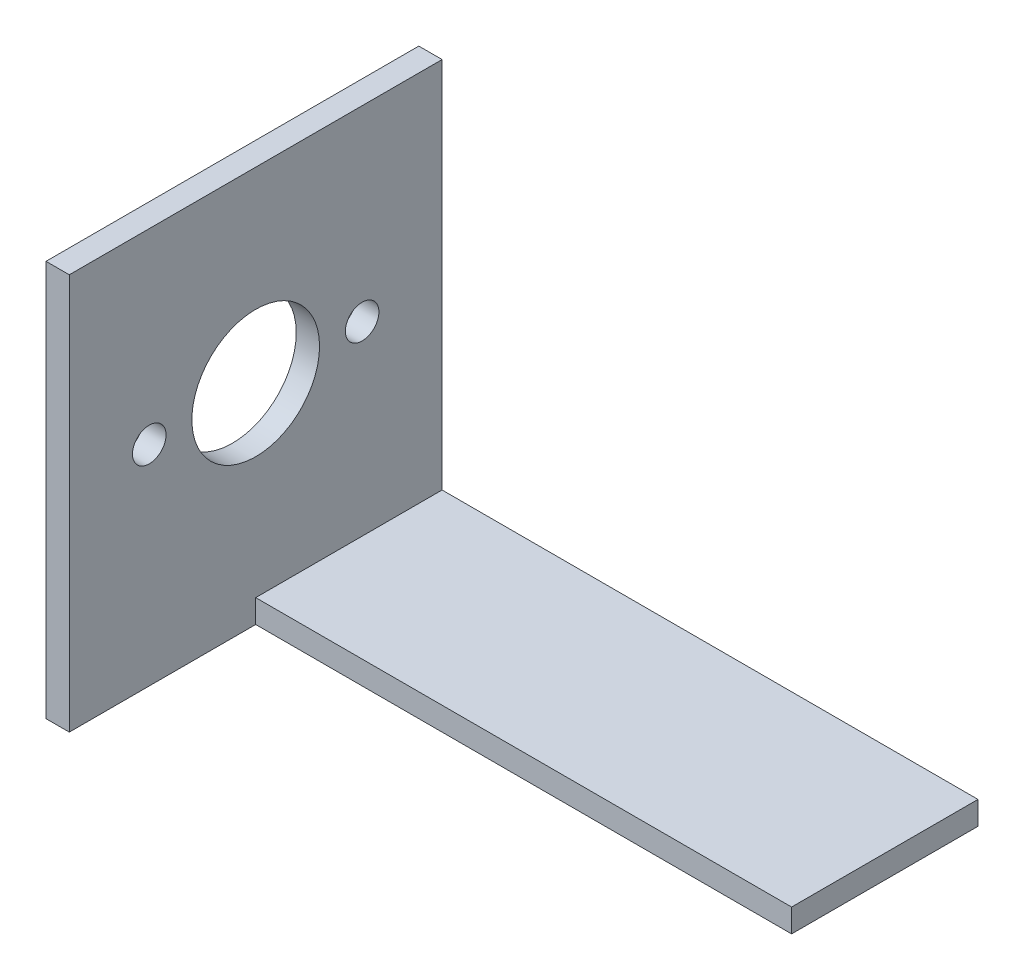
ISO-10303-21;
HEADER;
FILE_DESCRIPTION(('STEP AP214'),'2;1');
FILE_NAME('part.step','',(''),(''),'','','');
FILE_SCHEMA(('AUTOMOTIVE_DESIGN { 1 0 10303 214 1 1 1 1 }'));
ENDSEC;
DATA;
#1=APPLICATION_CONTEXT('core data for automotive mechanical design processes');
#2=APPLICATION_PROTOCOL_DEFINITION('international standard','automotive_design',2000,#1);
#3=PRODUCT_CONTEXT('',#1,'mechanical');
#4=PRODUCT('Part','Part','',(#3));
#5=PRODUCT_RELATED_PRODUCT_CATEGORY('part','',(#4));
#6=PRODUCT_DEFINITION_FORMATION('','',#4);
#7=PRODUCT_DEFINITION_CONTEXT('part definition',#1,'design');
#8=PRODUCT_DEFINITION('design','',#6,#7);
#9=PRODUCT_DEFINITION_SHAPE('','',#8);
#10=(LENGTH_UNIT() NAMED_UNIT(*) SI_UNIT(.MILLI.,.METRE.));
#11=(NAMED_UNIT(*) PLANE_ANGLE_UNIT() SI_UNIT($,.RADIAN.));
#12=(NAMED_UNIT(*) SI_UNIT($,.STERADIAN.) SOLID_ANGLE_UNIT());
#13=UNCERTAINTY_MEASURE_WITH_UNIT(LENGTH_MEASURE(1.E-05),#10,'distance_accuracy_value','');
#14=(GEOMETRIC_REPRESENTATION_CONTEXT(3) GLOBAL_UNCERTAINTY_ASSIGNED_CONTEXT((#13)) GLOBAL_UNIT_ASSIGNED_CONTEXT((#10,
#11,#12)) REPRESENTATION_CONTEXT('',''));
#15=CARTESIAN_POINT('',(0.,0.,0.));
#16=DIRECTION('',(0.,0.,1.));
#17=DIRECTION('',(1.,0.,0.));
#18=AXIS2_PLACEMENT_3D('',#15,#16,#17);
#19=CARTESIAN_POINT('',(0.,3.175,0.));
#20=DIRECTION('',(1.,0.,0.));
#21=DIRECTION('',(0.,0.,-1.));
#22=AXIS2_PLACEMENT_3D('',#19,#20,#21);
#23=PLANE('',#22);
#24=CARTESIAN_POINT('',(0.,28.4988,-25.4));
#25=DIRECTION('',(1.,0.,0.));
#26=DIRECTION('',(0.,0.,-1.));
#27=AXIS2_PLACEMENT_3D('',#24,#25,#26);
#28=CIRCLE('',#27,8.6995);
#29=CARTESIAN_POINT('',(0.,28.4988,-34.0995));
#30=VERTEX_POINT('',#29);
#31=EDGE_CURVE('E164',#30,#30,#28,.T.);
#32=ORIENTED_EDGE('',*,*,#31,.T.);
#33=EDGE_LOOP('',(#32));
#34=FACE_BOUND('',#33,.T.);
#35=CARTESIAN_POINT('',(0.,28.4988,-39.9034));
#36=DIRECTION('',(1.,0.,0.));
#37=DIRECTION('',(0.,0.,1.));
#38=AXIS2_PLACEMENT_3D('',#35,#36,#37);
#39=CIRCLE('',#38,2.28599999999999);
#40=CARTESIAN_POINT('',(0.,28.4988,-37.6174));
#41=VERTEX_POINT('',#40);
#42=EDGE_CURVE('E170',#41,#41,#39,.T.);
#43=ORIENTED_EDGE('',*,*,#42,.T.);
#44=EDGE_LOOP('',(#43));
#45=FACE_BOUND('',#44,.T.);
#46=CARTESIAN_POINT('',(0.,28.4988,-10.8966));
#47=DIRECTION('',(1.,0.,0.));
#48=DIRECTION('',(0.,0.,-1.));
#49=AXIS2_PLACEMENT_3D('',#46,#47,#48);
#50=CIRCLE('',#49,2.286);
#51=CARTESIAN_POINT('',(0.,28.4988,-13.1826));
#52=VERTEX_POINT('',#51);
#53=EDGE_CURVE('E176',#52,#52,#50,.T.);
#54=ORIENTED_EDGE('',*,*,#53,.T.);
#55=EDGE_LOOP('',(#54));
#56=FACE_BOUND('',#55,.T.);
#57=DIRECTION('',(0.,0.,1.));
#58=VECTOR('',#57,1.);
#59=CARTESIAN_POINT('',(0.,0.,0.));
#60=LINE('',#59,#58);
#61=CARTESIAN_POINT('',(0.,0.,-50.8));
#62=VERTEX_POINT('',#61);
#63=CARTESIAN_POINT('',(0.,0.,0.));
#64=VERTEX_POINT('',#63);
#65=EDGE_CURVE('E118',#62,#64,#60,.T.);
#66=ORIENTED_EDGE('',*,*,#65,.T.);
#67=DIRECTION('',(0.,-1.,0.));
#68=VECTOR('',#67,1.);
#69=CARTESIAN_POINT('',(0.,3.175,0.));
#70=LINE('',#69,#68);
#71=CARTESIAN_POINT('',(0.,53.975,0.));
#72=VERTEX_POINT('',#71);
#73=EDGE_CURVE('E11',#72,#64,#70,.T.);
#74=ORIENTED_EDGE('',*,*,#73,.F.);
#75=DIRECTION('',(0.,0.,-1.));
#76=VECTOR('',#75,1.);
#77=CARTESIAN_POINT('',(0.,53.975,-50.8));
#78=LINE('',#77,#76);
#79=CARTESIAN_POINT('',(0.,53.975,-50.8));
#80=VERTEX_POINT('',#79);
#81=EDGE_CURVE('E141',#72,#80,#78,.T.);
#82=ORIENTED_EDGE('',*,*,#81,.T.);
#83=DIRECTION('',(0.,-1.,0.));
#84=VECTOR('',#83,1.);
#85=CARTESIAN_POINT('',(0.,3.175,-50.8));
#86=LINE('',#85,#84);
#87=EDGE_CURVE('E128',#80,#62,#86,.T.);
#88=ORIENTED_EDGE('',*,*,#87,.T.);
#89=EDGE_LOOP('',(#66,#74,#82,#88));
#90=FACE_BOUND('',#89,.T.);
#91=ADVANCED_FACE('F35',(#34,#45,#56,#90),#23,.F.);
#92=CARTESIAN_POINT('',(0.,3.175,0.));
#93=DIRECTION('',(0.,0.,-1.));
#94=DIRECTION('',(-1.,0.,0.));
#95=AXIS2_PLACEMENT_3D('',#92,#93,#94);
#96=PLANE('',#95);
#97=DIRECTION('',(1.,0.,0.));
#98=VECTOR('',#97,1.);
#99=CARTESIAN_POINT('',(0.,0.,0.));
#100=LINE('',#99,#98);
#101=CARTESIAN_POINT('',(3.175,0.,0.));
#102=VERTEX_POINT('',#101);
#103=EDGE_CURVE('E111',#64,#102,#100,.T.);
#104=ORIENTED_EDGE('',*,*,#103,.T.);
#105=DIRECTION('',(0.,1.,0.));
#106=VECTOR('',#105,1.);
#107=CARTESIAN_POINT('',(3.175,0.,0.));
#108=LINE('',#107,#106);
#109=CARTESIAN_POINT('',(3.175,53.975,0.));
#110=VERTEX_POINT('',#109);
#111=EDGE_CURVE('E94',#102,#110,#108,.T.);
#112=ORIENTED_EDGE('',*,*,#111,.T.);
#113=DIRECTION('',(-1.,0.,0.));
#114=VECTOR('',#113,1.);
#115=CARTESIAN_POINT('',(3.175,53.975,0.));
#116=LINE('',#115,#114);
#117=EDGE_CURVE('E146',#110,#72,#116,.T.);
#118=ORIENTED_EDGE('',*,*,#117,.T.);
#119=ORIENTED_EDGE('',*,*,#73,.T.);
#120=EDGE_LOOP('',(#104,#112,#118,#119));
#121=FACE_BOUND('',#120,.T.);
#122=ADVANCED_FACE('F115',(#121),#96,.F.);
#123=CARTESIAN_POINT('',(76.2,3.175,0.));
#124=DIRECTION('',(-1.,0.,0.));
#125=DIRECTION('',(0.,0.,1.));
#126=AXIS2_PLACEMENT_3D('',#123,#124,#125);
#127=PLANE('',#126);
#128=DIRECTION('',(0.,0.,-1.));
#129=VECTOR('',#128,1.);
#130=CARTESIAN_POINT('',(76.2,3.175,0.));
#131=LINE('',#130,#129);
#132=CARTESIAN_POINT('',(76.2,3.175,-25.4));
#133=VERTEX_POINT('',#132);
#134=CARTESIAN_POINT('',(76.2,3.175,-50.8));
#135=VERTEX_POINT('',#134);
#136=EDGE_CURVE('E127',#133,#135,#131,.T.);
#137=ORIENTED_EDGE('',*,*,#136,.F.);
#138=DIRECTION('',(0.,1.,0.));
#139=VECTOR('',#138,1.);
#140=CARTESIAN_POINT('',(76.2,0.,-25.4));
#141=LINE('',#140,#139);
#142=CARTESIAN_POINT('',(76.2,0.,-25.4));
#143=VERTEX_POINT('',#142);
#144=EDGE_CURVE('E156',#143,#133,#141,.T.);
#145=ORIENTED_EDGE('',*,*,#144,.F.);
#146=DIRECTION('',(0.,0.,-1.));
#147=VECTOR('',#146,1.);
#148=CARTESIAN_POINT('',(76.2,0.,0.));
#149=LINE('',#148,#147);
#150=CARTESIAN_POINT('',(76.2,0.,-50.8));
#151=VERTEX_POINT('',#150);
#152=EDGE_CURVE('E117',#143,#151,#149,.T.);
#153=ORIENTED_EDGE('',*,*,#152,.T.);
#154=DIRECTION('',(0.,-1.,0.));
#155=VECTOR('',#154,1.);
#156=CARTESIAN_POINT('',(76.2,3.175,-50.8));
#157=LINE('',#156,#155);
#158=EDGE_CURVE('E42',#135,#151,#157,.T.);
#159=ORIENTED_EDGE('',*,*,#158,.F.);
#160=EDGE_LOOP('',(#137,#145,#153,#159));
#161=FACE_BOUND('',#160,.T.);
#162=ADVANCED_FACE('F155',(#161),#127,.F.);
#163=CARTESIAN_POINT('',(0.,3.175,-50.8));
#164=DIRECTION('',(0.,0.,1.));
#165=DIRECTION('',(1.,0.,0.));
#166=AXIS2_PLACEMENT_3D('',#163,#164,#165);
#167=PLANE('',#166);
#168=DIRECTION('',(-1.,0.,0.));
#169=VECTOR('',#168,1.);
#170=CARTESIAN_POINT('',(0.,0.,-50.8));
#171=LINE('',#170,#169);
#172=EDGE_CURVE('E120',#151,#62,#171,.T.);
#173=ORIENTED_EDGE('',*,*,#172,.T.);
#174=ORIENTED_EDGE('',*,*,#87,.F.);
#175=DIRECTION('',(-1.,0.,0.));
#176=VECTOR('',#175,1.);
#177=CARTESIAN_POINT('',(3.175,53.975,-50.8));
#178=LINE('',#177,#176);
#179=CARTESIAN_POINT('',(3.175,53.975,-50.8));
#180=VERTEX_POINT('',#179);
#181=EDGE_CURVE('E143',#180,#80,#178,.T.);
#182=ORIENTED_EDGE('',*,*,#181,.F.);
#183=DIRECTION('',(0.,-1.,0.));
#184=VECTOR('',#183,1.);
#185=CARTESIAN_POINT('',(3.175,0.,-50.8));
#186=LINE('',#185,#184);
#187=CARTESIAN_POINT('',(3.175,3.175,-50.8));
#188=VERTEX_POINT('',#187);
#189=EDGE_CURVE('E106',#180,#188,#186,.T.);
#190=ORIENTED_EDGE('',*,*,#189,.T.);
#191=DIRECTION('',(-1.,0.,0.));
#192=VECTOR('',#191,1.);
#193=CARTESIAN_POINT('',(0.,3.175,-50.8));
#194=LINE('',#193,#192);
#195=EDGE_CURVE('E57',#135,#188,#194,.T.);
#196=ORIENTED_EDGE('',*,*,#195,.F.);
#197=ORIENTED_EDGE('',*,*,#158,.T.);
#198=EDGE_LOOP('',(#173,#174,#182,#190,#196,#197));
#199=FACE_BOUND('',#198,.T.);
#200=ADVANCED_FACE('F134',(#199),#167,.F.);
#201=CARTESIAN_POINT('',(0.,3.175,0.));
#202=DIRECTION('',(0.,-1.,0.));
#203=DIRECTION('',(0.,0.,-1.));
#204=AXIS2_PLACEMENT_3D('',#201,#202,#203);
#205=PLANE('',#204);
#206=DIRECTION('',(0.,0.,1.));
#207=VECTOR('',#206,1.);
#208=CARTESIAN_POINT('',(3.175,3.175,0.));
#209=LINE('',#208,#207);
#210=CARTESIAN_POINT('',(3.175,3.175,-25.4));
#211=VERTEX_POINT('',#210);
#212=EDGE_CURVE('E122',#188,#211,#209,.T.);
#213=ORIENTED_EDGE('',*,*,#212,.T.);
#214=DIRECTION('',(-1.,0.,0.));
#215=VECTOR('',#214,1.);
#216=CARTESIAN_POINT('',(3.175,3.175,-25.4));
#217=LINE('',#216,#215);
#218=EDGE_CURVE('E49',#133,#211,#217,.T.);
#219=ORIENTED_EDGE('',*,*,#218,.F.);
#220=ORIENTED_EDGE('',*,*,#136,.T.);
#221=ORIENTED_EDGE('',*,*,#195,.T.);
#222=EDGE_LOOP('',(#213,#219,#220,#221));
#223=FACE_BOUND('',#222,.T.);
#224=ADVANCED_FACE('F153',(#223),#205,.F.);
#225=CARTESIAN_POINT('',(0.,0.,0.));
#226=DIRECTION('',(0.,-1.,0.));
#227=DIRECTION('',(0.,0.,-1.));
#228=AXIS2_PLACEMENT_3D('',#225,#226,#227);
#229=PLANE('',#228);
#230=DIRECTION('',(0.,0.,1.));
#231=VECTOR('',#230,1.);
#232=CARTESIAN_POINT('',(3.175,0.,0.));
#233=LINE('',#232,#231);
#234=CARTESIAN_POINT('',(3.175,0.,-25.4));
#235=VERTEX_POINT('',#234);
#236=EDGE_CURVE('E97',#235,#102,#233,.T.);
#237=ORIENTED_EDGE('',*,*,#236,.T.);
#238=ORIENTED_EDGE('',*,*,#103,.F.);
#239=ORIENTED_EDGE('',*,*,#65,.F.);
#240=ORIENTED_EDGE('',*,*,#172,.F.);
#241=ORIENTED_EDGE('',*,*,#152,.F.);
#242=DIRECTION('',(-1.,0.,0.));
#243=VECTOR('',#242,1.);
#244=CARTESIAN_POINT('',(3.175,0.,-25.4));
#245=LINE('',#244,#243);
#246=EDGE_CURVE('E113',#143,#235,#245,.T.);
#247=ORIENTED_EDGE('',*,*,#246,.T.);
#248=EDGE_LOOP('',(#237,#238,#239,#240,#241,#247));
#249=FACE_BOUND('',#248,.T.);
#250=ADVANCED_FACE('F109',(#249),#229,.T.);
#251=CARTESIAN_POINT('',(3.175,0.,0.));
#252=DIRECTION('',(1.,0.,0.));
#253=DIRECTION('',(0.,0.,-1.));
#254=AXIS2_PLACEMENT_3D('',#251,#252,#253);
#255=PLANE('',#254);
#256=CARTESIAN_POINT('',(3.175,28.4988,-25.4));
#257=DIRECTION('',(1.,0.,0.));
#258=DIRECTION('',(0.,0.,-1.));
#259=AXIS2_PLACEMENT_3D('',#256,#257,#258);
#260=CIRCLE('',#259,8.6995);
#261=CARTESIAN_POINT('',(3.175,28.4988,-34.0995));
#262=VERTEX_POINT('',#261);
#263=EDGE_CURVE('E159',#262,#262,#260,.T.);
#264=ORIENTED_EDGE('',*,*,#263,.F.);
#265=EDGE_LOOP('',(#264));
#266=FACE_BOUND('',#265,.T.);
#267=CARTESIAN_POINT('',(3.175,28.4988,-39.9034));
#268=DIRECTION('',(1.,0.,0.));
#269=DIRECTION('',(0.,0.,1.));
#270=AXIS2_PLACEMENT_3D('',#267,#268,#269);
#271=CIRCLE('',#270,2.28599999999999);
#272=CARTESIAN_POINT('',(3.175,28.4988,-37.6174));
#273=VERTEX_POINT('',#272);
#274=EDGE_CURVE('E167',#273,#273,#271,.T.);
#275=ORIENTED_EDGE('',*,*,#274,.F.);
#276=EDGE_LOOP('',(#275));
#277=FACE_BOUND('',#276,.T.);
#278=CARTESIAN_POINT('',(3.175,28.4988,-10.8966));
#279=DIRECTION('',(1.,0.,0.));
#280=DIRECTION('',(0.,0.,-1.));
#281=AXIS2_PLACEMENT_3D('',#278,#279,#280);
#282=CIRCLE('',#281,2.286);
#283=CARTESIAN_POINT('',(3.175,28.4988,-13.1826));
#284=VERTEX_POINT('',#283);
#285=EDGE_CURVE('E173',#284,#284,#282,.T.);
#286=ORIENTED_EDGE('',*,*,#285,.F.);
#287=EDGE_LOOP('',(#286));
#288=FACE_BOUND('',#287,.T.);
#289=ORIENTED_EDGE('',*,*,#212,.F.);
#290=ORIENTED_EDGE('',*,*,#189,.F.);
#291=DIRECTION('',(0.,0.,-1.));
#292=VECTOR('',#291,1.);
#293=CARTESIAN_POINT('',(3.175,53.975,-50.8));
#294=LINE('',#293,#292);
#295=EDGE_CURVE('E101',#110,#180,#294,.T.);
#296=ORIENTED_EDGE('',*,*,#295,.F.);
#297=ORIENTED_EDGE('',*,*,#111,.F.);
#298=ORIENTED_EDGE('',*,*,#236,.F.);
#299=DIRECTION('',(0.,1.,0.));
#300=VECTOR('',#299,1.);
#301=CARTESIAN_POINT('',(3.175,0.,-25.4));
#302=LINE('',#301,#300);
#303=EDGE_CURVE('E157',#235,#211,#302,.T.);
#304=ORIENTED_EDGE('',*,*,#303,.T.);
#305=EDGE_LOOP('',(#289,#290,#296,#297,#298,#304));
#306=FACE_BOUND('',#305,.T.);
#307=ADVANCED_FACE('F96',(#266,#277,#288,#306),#255,.T.);
#308=CARTESIAN_POINT('',(3.175,53.975,-50.8));
#309=DIRECTION('',(0.,1.,0.));
#310=DIRECTION('',(0.,0.,1.));
#311=AXIS2_PLACEMENT_3D('',#308,#309,#310);
#312=PLANE('',#311);
#313=ORIENTED_EDGE('',*,*,#81,.F.);
#314=ORIENTED_EDGE('',*,*,#117,.F.);
#315=ORIENTED_EDGE('',*,*,#295,.T.);
#316=ORIENTED_EDGE('',*,*,#181,.T.);
#317=EDGE_LOOP('',(#313,#314,#315,#316));
#318=FACE_BOUND('',#317,.T.);
#319=ADVANCED_FACE('F145',(#318),#312,.T.);
#320=CARTESIAN_POINT('',(0.,28.4988,-10.8966));
#321=DIRECTION('',(1.,0.,0.));
#322=DIRECTION('',(0.,0.,-1.));
#323=AXIS2_PLACEMENT_3D('',#320,#321,#322);
#324=CYLINDRICAL_SURFACE('',#323,2.286);
#325=ORIENTED_EDGE('',*,*,#53,.F.);
#326=EDGE_LOOP('',(#325));
#327=FACE_BOUND('',#326,.T.);
#328=ORIENTED_EDGE('',*,*,#285,.T.);
#329=EDGE_LOOP('',(#328));
#330=FACE_BOUND('',#329,.T.);
#331=ADVANCED_FACE('F202',(#327,#330),#324,.F.);
#332=CARTESIAN_POINT('',(0.,28.4988,-39.9034));
#333=DIRECTION('',(1.,0.,0.));
#334=DIRECTION('',(0.,0.,-1.));
#335=AXIS2_PLACEMENT_3D('',#332,#333,#334);
#336=CYLINDRICAL_SURFACE('',#335,2.28599999999999);
#337=ORIENTED_EDGE('',*,*,#42,.F.);
#338=EDGE_LOOP('',(#337));
#339=FACE_BOUND('',#338,.T.);
#340=ORIENTED_EDGE('',*,*,#274,.T.);
#341=EDGE_LOOP('',(#340));
#342=FACE_BOUND('',#341,.T.);
#343=ADVANCED_FACE('F188',(#339,#342),#336,.F.);
#344=CARTESIAN_POINT('',(0.,28.4988,-25.4));
#345=DIRECTION('',(1.,0.,0.));
#346=DIRECTION('',(0.,0.,-1.));
#347=AXIS2_PLACEMENT_3D('',#344,#345,#346);
#348=CYLINDRICAL_SURFACE('',#347,8.6995);
#349=ORIENTED_EDGE('',*,*,#31,.F.);
#350=EDGE_LOOP('',(#349));
#351=FACE_BOUND('',#350,.T.);
#352=ORIENTED_EDGE('',*,*,#263,.T.);
#353=EDGE_LOOP('',(#352));
#354=FACE_BOUND('',#353,.T.);
#355=ADVANCED_FACE('F183',(#351,#354),#348,.F.);
#356=CARTESIAN_POINT('',(3.175,0.,-25.4));
#357=DIRECTION('',(0.,0.,-1.));
#358=DIRECTION('',(-1.,0.,0.));
#359=AXIS2_PLACEMENT_3D('',#356,#357,#358);
#360=PLANE('',#359);
#361=ORIENTED_EDGE('',*,*,#218,.T.);
#362=ORIENTED_EDGE('',*,*,#303,.F.);
#363=ORIENTED_EDGE('',*,*,#246,.F.);
#364=ORIENTED_EDGE('',*,*,#144,.T.);
#365=EDGE_LOOP('',(#361,#362,#363,#364));
#366=FACE_BOUND('',#365,.T.);
#367=ADVANCED_FACE('F181',(#366),#360,.F.);
#368=CLOSED_SHELL('',(#91,#122,#162,#200,#224,#250,#307,#319,#331,#343,#355,#367));
#369=MANIFOLD_SOLID_BREP('B2',#368);
#370=ADVANCED_BREP_SHAPE_REPRESENTATION('',(#18,#369),#14);
#371=SHAPE_DEFINITION_REPRESENTATION(#9,#370);
ENDSEC;
END-ISO-10303-21;
